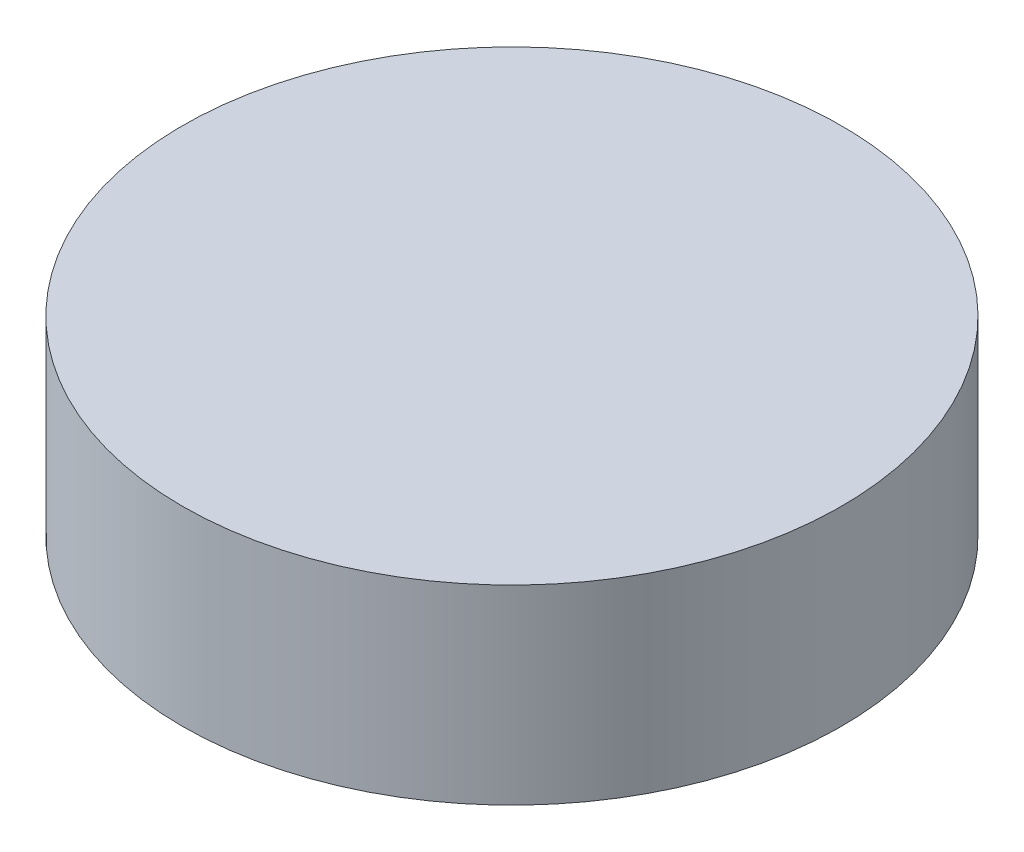
ISO-10303-21;
HEADER;
FILE_DESCRIPTION(('STEP AP214'),'2;1');
FILE_NAME('part.step','',(''),(''),'','','');
FILE_SCHEMA(('AUTOMOTIVE_DESIGN { 1 0 10303 214 1 1 1 1 }'));
ENDSEC;
DATA;
#1=APPLICATION_CONTEXT('core data for automotive mechanical design processes');
#2=APPLICATION_PROTOCOL_DEFINITION('international standard','automotive_design',2000,#1);
#3=PRODUCT_CONTEXT('',#1,'mechanical');
#4=PRODUCT('Part','Part','',(#3));
#5=PRODUCT_RELATED_PRODUCT_CATEGORY('part','',(#4));
#6=PRODUCT_DEFINITION_FORMATION('','',#4);
#7=PRODUCT_DEFINITION_CONTEXT('part definition',#1,'design');
#8=PRODUCT_DEFINITION('design','',#6,#7);
#9=PRODUCT_DEFINITION_SHAPE('','',#8);
#10=(LENGTH_UNIT() NAMED_UNIT(*) SI_UNIT(.MILLI.,.METRE.));
#11=(NAMED_UNIT(*) PLANE_ANGLE_UNIT() SI_UNIT($,.RADIAN.));
#12=(NAMED_UNIT(*) SI_UNIT($,.STERADIAN.) SOLID_ANGLE_UNIT());
#13=UNCERTAINTY_MEASURE_WITH_UNIT(LENGTH_MEASURE(1.E-05),#10,'distance_accuracy_value','');
#14=(GEOMETRIC_REPRESENTATION_CONTEXT(3) GLOBAL_UNCERTAINTY_ASSIGNED_CONTEXT((#13)) GLOBAL_UNIT_ASSIGNED_CONTEXT((#10,
#11,#12)) REPRESENTATION_CONTEXT('',''));
#15=CARTESIAN_POINT('',(0.,0.,0.));
#16=DIRECTION('',(0.,0.,1.));
#17=DIRECTION('',(1.,0.,0.));
#18=AXIS2_PLACEMENT_3D('',#15,#16,#17);
#19=CARTESIAN_POINT('',(0.,21.082,0.));
#20=DIRECTION('',(0.,-1.,0.));
#21=DIRECTION('',(0.,0.,-1.));
#22=AXIS2_PLACEMENT_3D('',#19,#20,#21);
#23=CYLINDRICAL_SURFACE('',#22,36.449);
#24=CARTESIAN_POINT('',(0.,21.082,0.));
#25=DIRECTION('',(0.,1.,0.));
#26=DIRECTION('',(0.,0.,1.));
#27=AXIS2_PLACEMENT_3D('',#24,#25,#26);
#28=CIRCLE('',#27,36.449);
#29=CARTESIAN_POINT('',(0.,21.082,36.449));
#30=VERTEX_POINT('',#29);
#31=EDGE_CURVE('E10',#30,#30,#28,.T.);
#32=ORIENTED_EDGE('',*,*,#31,.F.);
#33=EDGE_LOOP('',(#32));
#34=FACE_BOUND('',#33,.T.);
#35=CARTESIAN_POINT('',(0.,0.,0.));
#36=DIRECTION('',(0.,1.,0.));
#37=DIRECTION('',(0.,0.,1.));
#38=AXIS2_PLACEMENT_3D('',#35,#36,#37);
#39=CIRCLE('',#38,36.449);
#40=CARTESIAN_POINT('',(0.,0.,36.449));
#41=VERTEX_POINT('',#40);
#42=EDGE_CURVE('E33',#41,#41,#39,.T.);
#43=ORIENTED_EDGE('',*,*,#42,.T.);
#44=EDGE_LOOP('',(#43));
#45=FACE_BOUND('',#44,.T.);
#46=ADVANCED_FACE('F30',(#34,#45),#23,.T.);
#47=CARTESIAN_POINT('',(0.,21.082,0.));
#48=DIRECTION('',(0.,1.,0.));
#49=DIRECTION('',(0.,0.,1.));
#50=AXIS2_PLACEMENT_3D('',#47,#48,#49);
#51=PLANE('',#50);
#52=ORIENTED_EDGE('',*,*,#31,.T.);
#53=EDGE_LOOP('',(#52));
#54=FACE_BOUND('',#53,.T.);
#55=ADVANCED_FACE('F45',(#54),#51,.T.);
#56=CARTESIAN_POINT('',(0.,0.,0.));
#57=DIRECTION('',(0.,1.,0.));
#58=DIRECTION('',(0.,0.,1.));
#59=AXIS2_PLACEMENT_3D('',#56,#57,#58);
#60=PLANE('',#59);
#61=ORIENTED_EDGE('',*,*,#42,.F.);
#62=EDGE_LOOP('',(#61));
#63=FACE_BOUND('',#62,.T.);
#64=ADVANCED_FACE('F43',(#63),#60,.F.);
#65=CLOSED_SHELL('',(#46,#55,#64));
#66=MANIFOLD_SOLID_BREP('B2',#65);
#67=ADVANCED_BREP_SHAPE_REPRESENTATION('',(#18,#66),#14);
#68=SHAPE_DEFINITION_REPRESENTATION(#9,#67);
ENDSEC;
END-ISO-10303-21;
